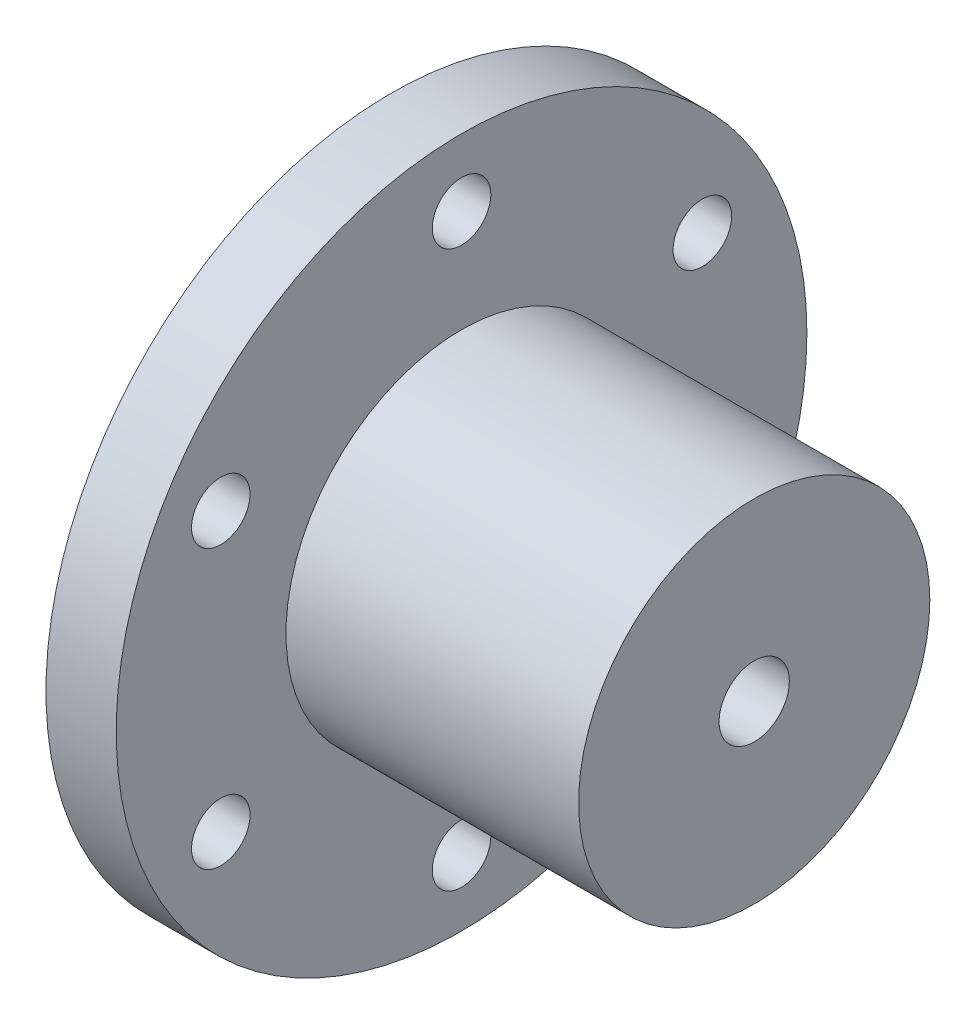
ISO-10303-21;
HEADER;
FILE_DESCRIPTION(('STEP AP214'),'2;1');
FILE_NAME('part.step','',(''),(''),'','','');
FILE_SCHEMA(('AUTOMOTIVE_DESIGN { 1 0 10303 214 1 1 1 1 }'));
ENDSEC;
DATA;
#1=APPLICATION_CONTEXT('core data for automotive mechanical design processes');
#2=APPLICATION_PROTOCOL_DEFINITION('international standard','automotive_design',2000,#1);
#3=PRODUCT_CONTEXT('',#1,'mechanical');
#4=PRODUCT('Part','Part','',(#3));
#5=PRODUCT_RELATED_PRODUCT_CATEGORY('part','',(#4));
#6=PRODUCT_DEFINITION_FORMATION('','',#4);
#7=PRODUCT_DEFINITION_CONTEXT('part definition',#1,'design');
#8=PRODUCT_DEFINITION('design','',#6,#7);
#9=PRODUCT_DEFINITION_SHAPE('','',#8);
#10=(LENGTH_UNIT() NAMED_UNIT(*) SI_UNIT(.MILLI.,.METRE.));
#11=(NAMED_UNIT(*) PLANE_ANGLE_UNIT() SI_UNIT($,.RADIAN.));
#12=(NAMED_UNIT(*) SI_UNIT($,.STERADIAN.) SOLID_ANGLE_UNIT());
#13=UNCERTAINTY_MEASURE_WITH_UNIT(LENGTH_MEASURE(1.E-05),#10,'distance_accuracy_value','');
#14=(GEOMETRIC_REPRESENTATION_CONTEXT(3) GLOBAL_UNCERTAINTY_ASSIGNED_CONTEXT((#13)) GLOBAL_UNIT_ASSIGNED_CONTEXT((#10,
#11,#12)) REPRESENTATION_CONTEXT('',''));
#15=CARTESIAN_POINT('',(0.,0.,0.));
#16=DIRECTION('',(0.,0.,1.));
#17=DIRECTION('',(1.,0.,0.));
#18=AXIS2_PLACEMENT_3D('',#15,#16,#17);
#19=CARTESIAN_POINT('',(6.,0.,0.));
#20=DIRECTION('',(-1.,0.,0.));
#21=DIRECTION('',(0.,0.,1.));
#22=AXIS2_PLACEMENT_3D('',#19,#20,#21);
#23=CYLINDRICAL_SURFACE('',#22,29.5);
#24=CARTESIAN_POINT('',(6.,0.,0.));
#25=DIRECTION('',(1.,0.,0.));
#26=DIRECTION('',(0.,0.,-1.));
#27=AXIS2_PLACEMENT_3D('',#24,#25,#26);
#28=CIRCLE('',#27,29.5);
#29=CARTESIAN_POINT('',(6.,0.,-29.5));
#30=VERTEX_POINT('',#29);
#31=EDGE_CURVE('E45',#30,#30,#28,.T.);
#32=ORIENTED_EDGE('',*,*,#31,.F.);
#33=EDGE_LOOP('',(#32));
#34=FACE_BOUND('',#33,.T.);
#35=CARTESIAN_POINT('',(0.,0.,0.));
#36=DIRECTION('',(1.,0.,0.));
#37=DIRECTION('',(0.,0.,-1.));
#38=AXIS2_PLACEMENT_3D('',#35,#36,#37);
#39=CIRCLE('',#38,29.5);
#40=CARTESIAN_POINT('',(0.,0.,-29.5));
#41=VERTEX_POINT('',#40);
#42=EDGE_CURVE('E51',#41,#41,#39,.T.);
#43=ORIENTED_EDGE('',*,*,#42,.T.);
#44=EDGE_LOOP('',(#43));
#45=FACE_BOUND('',#44,.T.);
#46=ADVANCED_FACE('F37',(#34,#45),#23,.T.);
#47=CARTESIAN_POINT('',(6.,0.,0.));
#48=DIRECTION('',(1.,0.,0.));
#49=DIRECTION('',(0.,0.,-1.));
#50=AXIS2_PLACEMENT_3D('',#47,#48,#49);
#51=PLANE('',#50);
#52=CARTESIAN_POINT('',(6.,23.75,0.));
#53=DIRECTION('',(1.,0.,0.));
#54=DIRECTION('',(0.,0.,-1.));
#55=AXIS2_PLACEMENT_3D('',#52,#53,#54);
#56=CIRCLE('',#55,2.5);
#57=CARTESIAN_POINT('',(6.,23.75,-2.5));
#58=VERTEX_POINT('',#57);
#59=EDGE_CURVE('E65',#58,#58,#56,.T.);
#60=ORIENTED_EDGE('',*,*,#59,.F.);
#61=EDGE_LOOP('',(#60));
#62=FACE_BOUND('',#61,.T.);
#63=CARTESIAN_POINT('',(6.,11.8749999999988,20.5681033398798));
#64=DIRECTION('',(1.,0.,0.));
#65=DIRECTION('',(0.,0.,-1.));
#66=AXIS2_PLACEMENT_3D('',#63,#64,#65);
#67=CIRCLE('',#66,2.50000000000126);
#68=CARTESIAN_POINT('',(6.,11.8749999999988,18.0681033398785));
#69=VERTEX_POINT('',#68);
#70=EDGE_CURVE('E100',#69,#69,#67,.T.);
#71=ORIENTED_EDGE('',*,*,#70,.F.);
#72=EDGE_LOOP('',(#71));
#73=FACE_BOUND('',#72,.T.);
#74=CARTESIAN_POINT('',(6.,-11.8750000000012,20.5681033398784));
#75=DIRECTION('',(1.,0.,0.));
#76=DIRECTION('',(0.,0.,-1.));
#77=AXIS2_PLACEMENT_3D('',#74,#75,#76);
#78=CIRCLE('',#77,2.50000000000248);
#79=CARTESIAN_POINT('',(6.,-11.8750000000012,18.0681033398759));
#80=VERTEX_POINT('',#79);
#81=EDGE_CURVE('E95',#80,#80,#78,.T.);
#82=ORIENTED_EDGE('',*,*,#81,.F.);
#83=EDGE_LOOP('',(#82));
#84=FACE_BOUND('',#83,.T.);
#85=CARTESIAN_POINT('',(6.,-23.75,-2.69133678744446E-12));
#86=DIRECTION('',(1.,0.,0.));
#87=DIRECTION('',(0.,0.,-1.));
#88=AXIS2_PLACEMENT_3D('',#85,#86,#87);
#89=CIRCLE('',#88,2.50000000000273);
#90=CARTESIAN_POINT('',(6.,-23.75,-2.50000000000542));
#91=VERTEX_POINT('',#90);
#92=EDGE_CURVE('E99',#91,#91,#89,.T.);
#93=ORIENTED_EDGE('',*,*,#92,.F.);
#94=EDGE_LOOP('',(#93));
#95=FACE_BOUND('',#94,.T.);
#96=CARTESIAN_POINT('',(6.,-11.8749999999988,-20.5681033398824));
#97=DIRECTION('',(1.,0.,0.));
#98=DIRECTION('',(0.,0.,-1.));
#99=AXIS2_PLACEMENT_3D('',#96,#97,#98);
#100=CIRCLE('',#99,2.5000000000017);
#101=CARTESIAN_POINT('',(6.,-11.8749999999988,-23.0681033398841));
#102=VERTEX_POINT('',#101);
#103=EDGE_CURVE('E104',#102,#102,#100,.T.);
#104=ORIENTED_EDGE('',*,*,#103,.F.);
#105=EDGE_LOOP('',(#104));
#106=FACE_BOUND('',#105,.T.);
#107=CARTESIAN_POINT('',(6.,11.8750000000012,-20.5681033398811));
#108=DIRECTION('',(1.,0.,0.));
#109=DIRECTION('',(0.,0.,-1.));
#110=AXIS2_PLACEMENT_3D('',#107,#108,#109);
#111=CIRCLE('',#110,2.50000000000036);
#112=CARTESIAN_POINT('',(6.,11.8750000000012,-23.0681033398815));
#113=VERTEX_POINT('',#112);
#114=EDGE_CURVE('E108',#113,#113,#111,.T.);
#115=ORIENTED_EDGE('',*,*,#114,.F.);
#116=EDGE_LOOP('',(#115));
#117=FACE_BOUND('',#116,.T.);
#118=CARTESIAN_POINT('',(6.,0.,0.));
#119=DIRECTION('',(1.,0.,0.));
#120=DIRECTION('',(0.,0.,-1.));
#121=AXIS2_PLACEMENT_3D('',#118,#119,#120);
#122=CIRCLE('',#121,15.);
#123=CARTESIAN_POINT('',(6.,0.,-15.));
#124=VERTEX_POINT('',#123);
#125=EDGE_CURVE('E10',#124,#124,#122,.T.);
#126=ORIENTED_EDGE('',*,*,#125,.F.);
#127=EDGE_LOOP('',(#126));
#128=FACE_BOUND('',#127,.T.);
#129=ORIENTED_EDGE('',*,*,#31,.T.);
#130=EDGE_LOOP('',(#129));
#131=FACE_BOUND('',#130,.T.);
#132=ADVANCED_FACE('F122',(#62,#73,#84,#95,#106,#117,#128,#131),#51,.T.);
#133=CARTESIAN_POINT('',(0.,0.,0.));
#134=DIRECTION('',(1.,0.,0.));
#135=DIRECTION('',(0.,0.,-1.));
#136=AXIS2_PLACEMENT_3D('',#133,#134,#135);
#137=PLANE('',#136);
#138=CARTESIAN_POINT('',(0.,23.75,0.));
#139=DIRECTION('',(1.,0.,0.));
#140=DIRECTION('',(0.,0.,-1.));
#141=AXIS2_PLACEMENT_3D('',#138,#139,#140);
#142=CIRCLE('',#141,2.5);
#143=CARTESIAN_POINT('',(0.,23.75,-2.5));
#144=VERTEX_POINT('',#143);
#145=EDGE_CURVE('E40',#144,#144,#142,.T.);
#146=ORIENTED_EDGE('',*,*,#145,.T.);
#147=EDGE_LOOP('',(#146));
#148=FACE_BOUND('',#147,.T.);
#149=CARTESIAN_POINT('',(0.,11.8749999999988,20.5681033398798));
#150=DIRECTION('',(1.,0.,0.));
#151=DIRECTION('',(0.,0.,-1.));
#152=AXIS2_PLACEMENT_3D('',#149,#150,#151);
#153=CIRCLE('',#152,2.50000000000126);
#154=CARTESIAN_POINT('',(0.,11.8749999999988,18.0681033398785));
#155=VERTEX_POINT('',#154);
#156=EDGE_CURVE('E76',#155,#155,#153,.T.);
#157=ORIENTED_EDGE('',*,*,#156,.T.);
#158=EDGE_LOOP('',(#157));
#159=FACE_BOUND('',#158,.T.);
#160=CARTESIAN_POINT('',(0.,-11.8750000000012,20.5681033398784));
#161=DIRECTION('',(1.,0.,0.));
#162=DIRECTION('',(0.,0.,-1.));
#163=AXIS2_PLACEMENT_3D('',#160,#161,#162);
#164=CIRCLE('',#163,2.50000000000248);
#165=CARTESIAN_POINT('',(0.,-11.8750000000012,18.0681033398759));
#166=VERTEX_POINT('',#165);
#167=EDGE_CURVE('E73',#166,#166,#164,.T.);
#168=ORIENTED_EDGE('',*,*,#167,.T.);
#169=EDGE_LOOP('',(#168));
#170=FACE_BOUND('',#169,.T.);
#171=CARTESIAN_POINT('',(0.,-23.75,-2.69133678744446E-12));
#172=DIRECTION('',(1.,0.,0.));
#173=DIRECTION('',(0.,0.,-1.));
#174=AXIS2_PLACEMENT_3D('',#171,#172,#173);
#175=CIRCLE('',#174,2.50000000000273);
#176=CARTESIAN_POINT('',(0.,-23.75,-2.50000000000542));
#177=VERTEX_POINT('',#176);
#178=EDGE_CURVE('E69',#177,#177,#175,.T.);
#179=ORIENTED_EDGE('',*,*,#178,.T.);
#180=EDGE_LOOP('',(#179));
#181=FACE_BOUND('',#180,.T.);
#182=CARTESIAN_POINT('',(0.,-11.8749999999988,-20.5681033398824));
#183=DIRECTION('',(1.,0.,0.));
#184=DIRECTION('',(0.,0.,-1.));
#185=AXIS2_PLACEMENT_3D('',#182,#183,#184);
#186=CIRCLE('',#185,2.5000000000017);
#187=CARTESIAN_POINT('',(0.,-11.8749999999988,-23.0681033398841));
#188=VERTEX_POINT('',#187);
#189=EDGE_CURVE('E64',#188,#188,#186,.T.);
#190=ORIENTED_EDGE('',*,*,#189,.T.);
#191=EDGE_LOOP('',(#190));
#192=FACE_BOUND('',#191,.T.);
#193=CARTESIAN_POINT('',(0.,11.8750000000012,-20.5681033398811));
#194=DIRECTION('',(1.,0.,0.));
#195=DIRECTION('',(0.,0.,-1.));
#196=AXIS2_PLACEMENT_3D('',#193,#194,#195);
#197=CIRCLE('',#196,2.50000000000036);
#198=CARTESIAN_POINT('',(0.,11.8750000000012,-23.0681033398815));
#199=VERTEX_POINT('',#198);
#200=EDGE_CURVE('E60',#199,#199,#197,.T.);
#201=ORIENTED_EDGE('',*,*,#200,.T.);
#202=EDGE_LOOP('',(#201));
#203=FACE_BOUND('',#202,.T.);
#204=ORIENTED_EDGE('',*,*,#42,.F.);
#205=EDGE_LOOP('',(#204));
#206=FACE_BOUND('',#205,.T.);
#207=ADVANCED_FACE('F125',(#148,#159,#170,#181,#192,#203,#206),#137,.F.);
#208=CARTESIAN_POINT('',(31.,0.,0.));
#209=DIRECTION('',(-1.,0.,0.));
#210=DIRECTION('',(0.,0.,1.));
#211=AXIS2_PLACEMENT_3D('',#208,#209,#210);
#212=CYLINDRICAL_SURFACE('',#211,15.);
#213=CARTESIAN_POINT('',(31.,0.,0.));
#214=DIRECTION('',(1.,0.,0.));
#215=DIRECTION('',(0.,0.,-1.));
#216=AXIS2_PLACEMENT_3D('',#213,#214,#215);
#217=CIRCLE('',#216,15.);
#218=CARTESIAN_POINT('',(31.,0.,-15.));
#219=VERTEX_POINT('',#218);
#220=EDGE_CURVE('E54',#219,#219,#217,.T.);
#221=ORIENTED_EDGE('',*,*,#220,.F.);
#222=EDGE_LOOP('',(#221));
#223=FACE_BOUND('',#222,.T.);
#224=ORIENTED_EDGE('',*,*,#125,.T.);
#225=EDGE_LOOP('',(#224));
#226=FACE_BOUND('',#225,.T.);
#227=ADVANCED_FACE('F145',(#223,#226),#212,.T.);
#228=CARTESIAN_POINT('',(31.,0.,0.));
#229=DIRECTION('',(1.,0.,0.));
#230=DIRECTION('',(0.,0.,-1.));
#231=AXIS2_PLACEMENT_3D('',#228,#229,#230);
#232=PLANE('',#231);
#233=CARTESIAN_POINT('',(31.,0.,0.));
#234=DIRECTION('',(1.,0.,0.));
#235=DIRECTION('',(0.,0.,-1.));
#236=AXIS2_PLACEMENT_3D('',#233,#234,#235);
#237=CIRCLE('',#236,3.);
#238=CARTESIAN_POINT('',(31.,0.,-3.));
#239=VERTEX_POINT('',#238);
#240=EDGE_CURVE('E83',#239,#239,#237,.T.);
#241=ORIENTED_EDGE('',*,*,#240,.F.);
#242=EDGE_LOOP('',(#241));
#243=FACE_BOUND('',#242,.T.);
#244=ORIENTED_EDGE('',*,*,#220,.T.);
#245=EDGE_LOOP('',(#244));
#246=FACE_BOUND('',#245,.T.);
#247=ADVANCED_FACE('F149',(#243,#246),#232,.T.);
#248=CARTESIAN_POINT('',(6.,0.,0.));
#249=DIRECTION('',(1.,0.,0.));
#250=DIRECTION('',(0.,0.,-1.));
#251=AXIS2_PLACEMENT_3D('',#248,#249,#250);
#252=CYLINDRICAL_SURFACE('',#251,3.);
#253=CARTESIAN_POINT('',(6.,0.,0.));
#254=DIRECTION('',(1.,0.,0.));
#255=DIRECTION('',(0.,0.,-1.));
#256=AXIS2_PLACEMENT_3D('',#253,#254,#255);
#257=CIRCLE('',#256,3.);
#258=CARTESIAN_POINT('',(6.,0.,-3.));
#259=VERTEX_POINT('',#258);
#260=EDGE_CURVE('E88',#259,#259,#257,.T.);
#261=ORIENTED_EDGE('',*,*,#260,.F.);
#262=EDGE_LOOP('',(#261));
#263=FACE_BOUND('',#262,.T.);
#264=ORIENTED_EDGE('',*,*,#240,.T.);
#265=EDGE_LOOP('',(#264));
#266=FACE_BOUND('',#265,.T.);
#267=ADVANCED_FACE('F155',(#263,#266),#252,.F.);
#268=CARTESIAN_POINT('',(6.,0.,0.));
#269=DIRECTION('',(1.,0.,0.));
#270=DIRECTION('',(0.,0.,-1.));
#271=AXIS2_PLACEMENT_3D('',#268,#269,#270);
#272=PLANE('',#271);
#273=ORIENTED_EDGE('',*,*,#260,.T.);
#274=EDGE_LOOP('',(#273));
#275=FACE_BOUND('',#274,.T.);
#276=ADVANCED_FACE('F159',(#275),#272,.T.);
#277=CARTESIAN_POINT('',(-19.,11.8750000000012,-20.5681033398811));
#278=DIRECTION('',(1.,0.,0.));
#279=DIRECTION('',(0.,0.,-1.));
#280=AXIS2_PLACEMENT_3D('',#277,#278,#279);
#281=CYLINDRICAL_SURFACE('',#280,2.50000000000036);
#282=ORIENTED_EDGE('',*,*,#114,.T.);
#283=EDGE_LOOP('',(#282));
#284=FACE_BOUND('',#283,.T.);
#285=ORIENTED_EDGE('',*,*,#200,.F.);
#286=EDGE_LOOP('',(#285));
#287=FACE_BOUND('',#286,.T.);
#288=ADVANCED_FACE('F163',(#284,#287),#281,.F.);
#289=CARTESIAN_POINT('',(-19.,-11.8749999999988,-20.5681033398824));
#290=DIRECTION('',(1.,0.,0.));
#291=DIRECTION('',(0.,0.,-1.));
#292=AXIS2_PLACEMENT_3D('',#289,#290,#291);
#293=CYLINDRICAL_SURFACE('',#292,2.5000000000017);
#294=ORIENTED_EDGE('',*,*,#103,.T.);
#295=EDGE_LOOP('',(#294));
#296=FACE_BOUND('',#295,.T.);
#297=ORIENTED_EDGE('',*,*,#189,.F.);
#298=EDGE_LOOP('',(#297));
#299=FACE_BOUND('',#298,.T.);
#300=ADVANCED_FACE('F173',(#296,#299),#293,.F.);
#301=CARTESIAN_POINT('',(-19.,-23.75,-2.69133678744446E-12));
#302=DIRECTION('',(1.,0.,0.));
#303=DIRECTION('',(0.,0.,-1.));
#304=AXIS2_PLACEMENT_3D('',#301,#302,#303);
#305=CYLINDRICAL_SURFACE('',#304,2.50000000000273);
#306=ORIENTED_EDGE('',*,*,#92,.T.);
#307=EDGE_LOOP('',(#306));
#308=FACE_BOUND('',#307,.T.);
#309=ORIENTED_EDGE('',*,*,#178,.F.);
#310=EDGE_LOOP('',(#309));
#311=FACE_BOUND('',#310,.T.);
#312=ADVANCED_FACE('F169',(#308,#311),#305,.F.);
#313=CARTESIAN_POINT('',(-19.,-11.8750000000012,20.5681033398784));
#314=DIRECTION('',(1.,0.,0.));
#315=DIRECTION('',(0.,0.,-1.));
#316=AXIS2_PLACEMENT_3D('',#313,#314,#315);
#317=CYLINDRICAL_SURFACE('',#316,2.50000000000248);
#318=ORIENTED_EDGE('',*,*,#81,.T.);
#319=EDGE_LOOP('',(#318));
#320=FACE_BOUND('',#319,.T.);
#321=ORIENTED_EDGE('',*,*,#167,.F.);
#322=EDGE_LOOP('',(#321));
#323=FACE_BOUND('',#322,.T.);
#324=ADVANCED_FACE('F165',(#320,#323),#317,.F.);
#325=CARTESIAN_POINT('',(-19.,11.8749999999988,20.5681033398798));
#326=DIRECTION('',(1.,0.,0.));
#327=DIRECTION('',(0.,0.,-1.));
#328=AXIS2_PLACEMENT_3D('',#325,#326,#327);
#329=CYLINDRICAL_SURFACE('',#328,2.50000000000126);
#330=ORIENTED_EDGE('',*,*,#70,.T.);
#331=EDGE_LOOP('',(#330));
#332=FACE_BOUND('',#331,.T.);
#333=ORIENTED_EDGE('',*,*,#156,.F.);
#334=EDGE_LOOP('',(#333));
#335=FACE_BOUND('',#334,.T.);
#336=ADVANCED_FACE('F168',(#332,#335),#329,.F.);
#337=CARTESIAN_POINT('',(-19.,23.75,0.));
#338=DIRECTION('',(1.,0.,0.));
#339=DIRECTION('',(0.,0.,-1.));
#340=AXIS2_PLACEMENT_3D('',#337,#338,#339);
#341=CYLINDRICAL_SURFACE('',#340,2.5);
#342=ORIENTED_EDGE('',*,*,#59,.T.);
#343=EDGE_LOOP('',(#342));
#344=FACE_BOUND('',#343,.T.);
#345=ORIENTED_EDGE('',*,*,#145,.F.);
#346=EDGE_LOOP('',(#345));
#347=FACE_BOUND('',#346,.T.);
#348=ADVANCED_FACE('F119',(#344,#347),#341,.F.);
#349=CLOSED_SHELL('',(#46,#132,#207,#227,#247,#267,#276,#288,#300,#312,#324,#336,#348));
#350=MANIFOLD_SOLID_BREP('B2',#349);
#351=ADVANCED_BREP_SHAPE_REPRESENTATION('',(#18,#350),#14);
#352=SHAPE_DEFINITION_REPRESENTATION(#9,#351);
ENDSEC;
END-ISO-10303-21;
